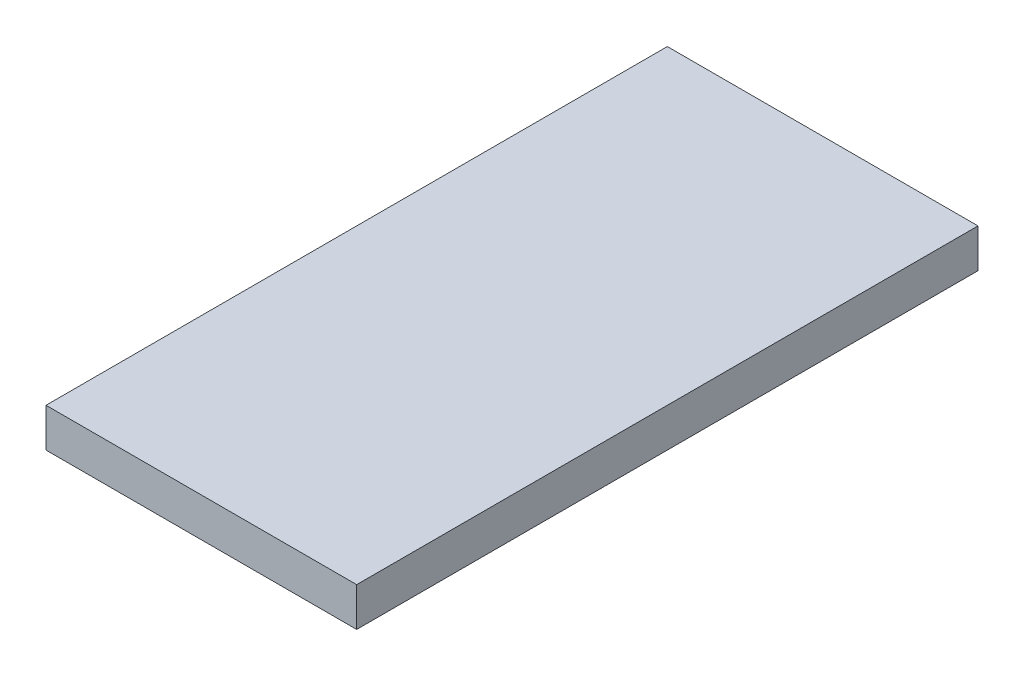
ISO-10303-21;
HEADER;
FILE_DESCRIPTION(('STEP AP214'),'2;1');
FILE_NAME('part.step','',(''),(''),'','','');
FILE_SCHEMA(('AUTOMOTIVE_DESIGN { 1 0 10303 214 1 1 1 1 }'));
ENDSEC;
DATA;
#1=APPLICATION_CONTEXT('core data for automotive mechanical design processes');
#2=APPLICATION_PROTOCOL_DEFINITION('international standard','automotive_design',2000,#1);
#3=PRODUCT_CONTEXT('',#1,'mechanical');
#4=PRODUCT('Part','Part','',(#3));
#5=PRODUCT_RELATED_PRODUCT_CATEGORY('part','',(#4));
#6=PRODUCT_DEFINITION_FORMATION('','',#4);
#7=PRODUCT_DEFINITION_CONTEXT('part definition',#1,'design');
#8=PRODUCT_DEFINITION('design','',#6,#7);
#9=PRODUCT_DEFINITION_SHAPE('','',#8);
#10=(LENGTH_UNIT() NAMED_UNIT(*) SI_UNIT(.MILLI.,.METRE.));
#11=(NAMED_UNIT(*) PLANE_ANGLE_UNIT() SI_UNIT($,.RADIAN.));
#12=(NAMED_UNIT(*) SI_UNIT($,.STERADIAN.) SOLID_ANGLE_UNIT());
#13=UNCERTAINTY_MEASURE_WITH_UNIT(LENGTH_MEASURE(1.E-05),#10,'distance_accuracy_value','');
#14=(GEOMETRIC_REPRESENTATION_CONTEXT(3) GLOBAL_UNCERTAINTY_ASSIGNED_CONTEXT((#13)) GLOBAL_UNIT_ASSIGNED_CONTEXT((#10,
#11,#12)) REPRESENTATION_CONTEXT('',''));
#15=CARTESIAN_POINT('',(0.,0.,0.));
#16=DIRECTION('',(0.,0.,1.));
#17=DIRECTION('',(1.,0.,0.));
#18=AXIS2_PLACEMENT_3D('',#15,#16,#17);
#19=CARTESIAN_POINT('',(304.8,38.1,609.6));
#20=DIRECTION('',(-1.,0.,0.));
#21=DIRECTION('',(0.,0.,1.));
#22=AXIS2_PLACEMENT_3D('',#19,#20,#21);
#23=PLANE('',#22);
#24=DIRECTION('',(0.,0.,-1.));
#25=VECTOR('',#24,1.);
#26=CARTESIAN_POINT('',(304.8,-38.1,609.6));
#27=LINE('',#26,#25);
#28=CARTESIAN_POINT('',(304.8,-38.1,609.6));
#29=VERTEX_POINT('',#28);
#30=CARTESIAN_POINT('',(304.8,-38.1,-609.6));
#31=VERTEX_POINT('',#30);
#32=EDGE_CURVE('E96',#29,#31,#27,.T.);
#33=ORIENTED_EDGE('',*,*,#32,.T.);
#34=DIRECTION('',(0.,-1.,0.));
#35=VECTOR('',#34,1.);
#36=CARTESIAN_POINT('',(304.8,38.1,-609.6));
#37=LINE('',#36,#35);
#38=CARTESIAN_POINT('',(304.8,38.1,-609.6));
#39=VERTEX_POINT('',#38);
#40=EDGE_CURVE('E11',#39,#31,#37,.T.);
#41=ORIENTED_EDGE('',*,*,#40,.F.);
#42=DIRECTION('',(0.,0.,-1.));
#43=VECTOR('',#42,1.);
#44=CARTESIAN_POINT('',(304.8,38.1,609.6));
#45=LINE('',#44,#43);
#46=CARTESIAN_POINT('',(304.8,38.1,609.6));
#47=VERTEX_POINT('',#46);
#48=EDGE_CURVE('E84',#47,#39,#45,.T.);
#49=ORIENTED_EDGE('',*,*,#48,.F.);
#50=DIRECTION('',(0.,-1.,0.));
#51=VECTOR('',#50,1.);
#52=CARTESIAN_POINT('',(304.8,38.1,609.6));
#53=LINE('',#52,#51);
#54=EDGE_CURVE('E92',#47,#29,#53,.T.);
#55=ORIENTED_EDGE('',*,*,#54,.T.);
#56=EDGE_LOOP('',(#33,#41,#49,#55));
#57=FACE_BOUND('',#56,.T.);
#58=ADVANCED_FACE('F33',(#57),#23,.F.);
#59=CARTESIAN_POINT('',(-304.8,38.1,-609.6));
#60=DIRECTION('',(0.,0.,1.));
#61=DIRECTION('',(1.,0.,0.));
#62=AXIS2_PLACEMENT_3D('',#59,#60,#61);
#63=PLANE('',#62);
#64=DIRECTION('',(-1.,0.,0.));
#65=VECTOR('',#64,1.);
#66=CARTESIAN_POINT('',(-304.8,-38.1,-609.6));
#67=LINE('',#66,#65);
#68=CARTESIAN_POINT('',(-304.8,-38.1,-609.6));
#69=VERTEX_POINT('',#68);
#70=EDGE_CURVE('E88',#31,#69,#67,.T.);
#71=ORIENTED_EDGE('',*,*,#70,.T.);
#72=DIRECTION('',(0.,-1.,0.));
#73=VECTOR('',#72,1.);
#74=CARTESIAN_POINT('',(-304.8,38.1,-609.6));
#75=LINE('',#74,#73);
#76=CARTESIAN_POINT('',(-304.8,38.1,-609.6));
#77=VERTEX_POINT('',#76);
#78=EDGE_CURVE('E41',#77,#69,#75,.T.);
#79=ORIENTED_EDGE('',*,*,#78,.F.);
#80=DIRECTION('',(-1.,0.,0.));
#81=VECTOR('',#80,1.);
#82=CARTESIAN_POINT('',(-304.8,38.1,-609.6));
#83=LINE('',#82,#81);
#84=EDGE_CURVE('E79',#39,#77,#83,.T.);
#85=ORIENTED_EDGE('',*,*,#84,.F.);
#86=ORIENTED_EDGE('',*,*,#40,.T.);
#87=EDGE_LOOP('',(#71,#79,#85,#86));
#88=FACE_BOUND('',#87,.T.);
#89=ADVANCED_FACE('F87',(#88),#63,.F.);
#90=CARTESIAN_POINT('',(-304.8,38.1,609.6));
#91=DIRECTION('',(1.,0.,0.));
#92=DIRECTION('',(0.,0.,-1.));
#93=AXIS2_PLACEMENT_3D('',#90,#91,#92);
#94=PLANE('',#93);
#95=DIRECTION('',(0.,0.,1.));
#96=VECTOR('',#95,1.);
#97=CARTESIAN_POINT('',(-304.8,-38.1,609.6));
#98=LINE('',#97,#96);
#99=CARTESIAN_POINT('',(-304.8,-38.1,609.6));
#100=VERTEX_POINT('',#99);
#101=EDGE_CURVE('E66',#69,#100,#98,.T.);
#102=ORIENTED_EDGE('',*,*,#101,.T.);
#103=DIRECTION('',(0.,-1.,0.));
#104=VECTOR('',#103,1.);
#105=CARTESIAN_POINT('',(-304.8,38.1,609.6));
#106=LINE('',#105,#104);
#107=CARTESIAN_POINT('',(-304.8,38.1,609.6));
#108=VERTEX_POINT('',#107);
#109=EDGE_CURVE('E89',#108,#100,#106,.T.);
#110=ORIENTED_EDGE('',*,*,#109,.F.);
#111=DIRECTION('',(0.,0.,1.));
#112=VECTOR('',#111,1.);
#113=CARTESIAN_POINT('',(-304.8,38.1,609.6));
#114=LINE('',#113,#112);
#115=EDGE_CURVE('E82',#77,#108,#114,.T.);
#116=ORIENTED_EDGE('',*,*,#115,.F.);
#117=ORIENTED_EDGE('',*,*,#78,.T.);
#118=EDGE_LOOP('',(#102,#110,#116,#117));
#119=FACE_BOUND('',#118,.T.);
#120=ADVANCED_FACE('F90',(#119),#94,.F.);
#121=CARTESIAN_POINT('',(-304.8,38.1,609.6));
#122=DIRECTION('',(0.,0.,-1.));
#123=DIRECTION('',(-1.,0.,0.));
#124=AXIS2_PLACEMENT_3D('',#121,#122,#123);
#125=PLANE('',#124);
#126=DIRECTION('',(1.,0.,0.));
#127=VECTOR('',#126,1.);
#128=CARTESIAN_POINT('',(-304.8,-38.1,609.6));
#129=LINE('',#128,#127);
#130=EDGE_CURVE('E72',#100,#29,#129,.T.);
#131=ORIENTED_EDGE('',*,*,#130,.T.);
#132=ORIENTED_EDGE('',*,*,#54,.F.);
#133=DIRECTION('',(1.,0.,0.));
#134=VECTOR('',#133,1.);
#135=CARTESIAN_POINT('',(-304.8,38.1,609.6));
#136=LINE('',#135,#134);
#137=EDGE_CURVE('E49',#108,#47,#136,.T.);
#138=ORIENTED_EDGE('',*,*,#137,.F.);
#139=ORIENTED_EDGE('',*,*,#109,.T.);
#140=EDGE_LOOP('',(#131,#132,#138,#139));
#141=FACE_BOUND('',#140,.T.);
#142=ADVANCED_FACE('F103',(#141),#125,.F.);
#143=CARTESIAN_POINT('',(0.,38.1,0.));
#144=DIRECTION('',(0.,-1.,0.));
#145=DIRECTION('',(0.,0.,-1.));
#146=AXIS2_PLACEMENT_3D('',#143,#144,#145);
#147=PLANE('',#146);
#148=ORIENTED_EDGE('',*,*,#48,.T.);
#149=ORIENTED_EDGE('',*,*,#84,.T.);
#150=ORIENTED_EDGE('',*,*,#115,.T.);
#151=ORIENTED_EDGE('',*,*,#137,.T.);
#152=EDGE_LOOP('',(#148,#149,#150,#151));
#153=FACE_BOUND('',#152,.T.);
#154=ADVANCED_FACE('F80',(#153),#147,.F.);
#155=CARTESIAN_POINT('',(0.,-38.1,0.));
#156=DIRECTION('',(0.,-1.,0.));
#157=DIRECTION('',(0.,0.,-1.));
#158=AXIS2_PLACEMENT_3D('',#155,#156,#157);
#159=PLANE('',#158);
#160=ORIENTED_EDGE('',*,*,#32,.F.);
#161=ORIENTED_EDGE('',*,*,#130,.F.);
#162=ORIENTED_EDGE('',*,*,#101,.F.);
#163=ORIENTED_EDGE('',*,*,#70,.F.);
#164=EDGE_LOOP('',(#160,#161,#162,#163));
#165=FACE_BOUND('',#164,.T.);
#166=ADVANCED_FACE('F106',(#165),#159,.T.);
#167=CLOSED_SHELL('',(#58,#89,#120,#142,#154,#166));
#168=MANIFOLD_SOLID_BREP('B2',#167);
#169=ADVANCED_BREP_SHAPE_REPRESENTATION('',(#18,#168),#14);
#170=SHAPE_DEFINITION_REPRESENTATION(#9,#169);
ENDSEC;
END-ISO-10303-21;
